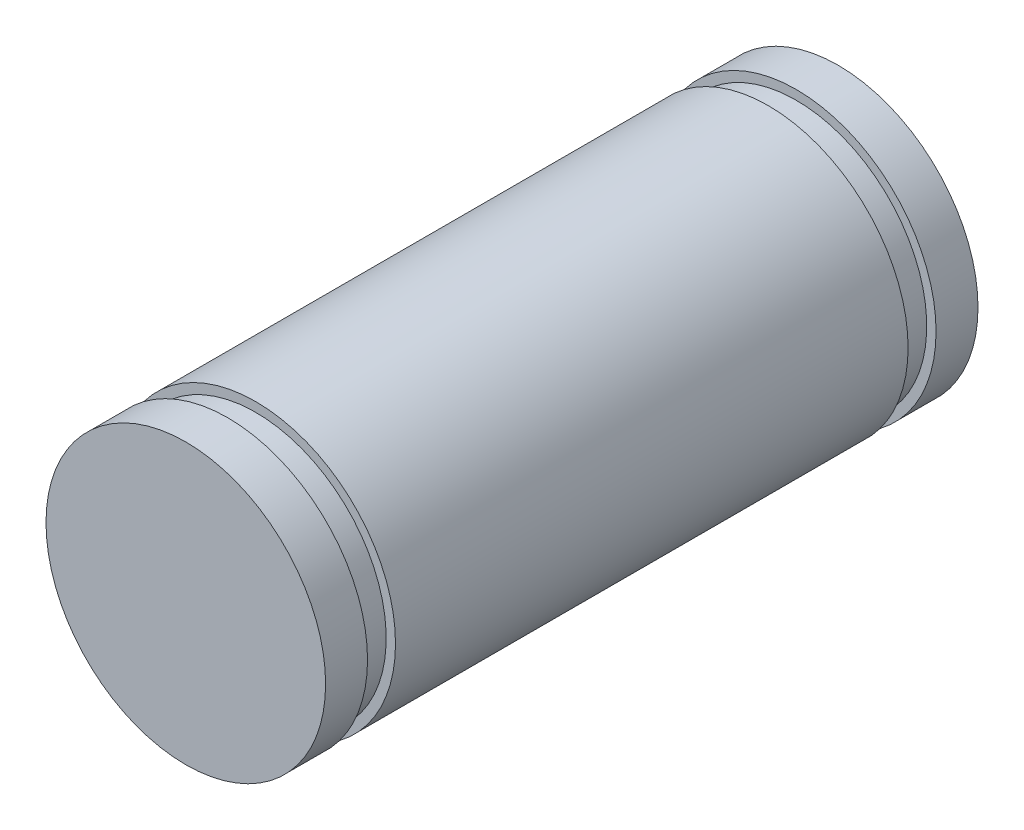
ISO-10303-21;
HEADER;
FILE_DESCRIPTION(('STEP AP214'),'2;1');
FILE_NAME('part.step','',(''),(''),'','','');
FILE_SCHEMA(('AUTOMOTIVE_DESIGN { 1 0 10303 214 1 1 1 1 }'));
ENDSEC;
DATA;
#1=APPLICATION_CONTEXT('core data for automotive mechanical design processes');
#2=APPLICATION_PROTOCOL_DEFINITION('international standard','automotive_design',2000,#1);
#3=PRODUCT_CONTEXT('',#1,'mechanical');
#4=PRODUCT('Part','Part','',(#3));
#5=PRODUCT_RELATED_PRODUCT_CATEGORY('part','',(#4));
#6=PRODUCT_DEFINITION_FORMATION('','',#4);
#7=PRODUCT_DEFINITION_CONTEXT('part definition',#1,'design');
#8=PRODUCT_DEFINITION('design','',#6,#7);
#9=PRODUCT_DEFINITION_SHAPE('','',#8);
#10=(LENGTH_UNIT() NAMED_UNIT(*) SI_UNIT(.MILLI.,.METRE.));
#11=(NAMED_UNIT(*) PLANE_ANGLE_UNIT() SI_UNIT($,.RADIAN.));
#12=(NAMED_UNIT(*) SI_UNIT($,.STERADIAN.) SOLID_ANGLE_UNIT());
#13=UNCERTAINTY_MEASURE_WITH_UNIT(LENGTH_MEASURE(1.E-05),#10,'distance_accuracy_value','');
#14=(GEOMETRIC_REPRESENTATION_CONTEXT(3) GLOBAL_UNCERTAINTY_ASSIGNED_CONTEXT((#13)) GLOBAL_UNIT_ASSIGNED_CONTEXT((#10,
#11,#12)) REPRESENTATION_CONTEXT('',''));
#15=CARTESIAN_POINT('',(0.,0.,0.));
#16=DIRECTION('',(0.,0.,1.));
#17=DIRECTION('',(1.,0.,0.));
#18=AXIS2_PLACEMENT_3D('',#15,#16,#17);
#19=CARTESIAN_POINT('',(0.,0.,14.));
#20=DIRECTION('',(0.,0.,1.));
#21=DIRECTION('',(1.,0.,0.));
#22=AXIS2_PLACEMENT_3D('',#19,#20,#21);
#23=PLANE('',#22);
#24=CARTESIAN_POINT('',(0.,0.,14.));
#25=DIRECTION('',(0.,0.,-1.));
#26=DIRECTION('',(-1.,0.,0.));
#27=AXIS2_PLACEMENT_3D('',#24,#25,#26);
#28=CIRCLE('',#27,3.);
#29=CARTESIAN_POINT('',(-3.,0.,14.));
#30=VERTEX_POINT('',#29);
#31=EDGE_CURVE('E18',#30,#30,#28,.T.);
#32=ORIENTED_EDGE('',*,*,#31,.F.);
#33=EDGE_LOOP('',(#32));
#34=FACE_BOUND('',#33,.T.);
#35=ADVANCED_FACE('F15',(#34),#23,.T.);
#36=CARTESIAN_POINT('',(0.,0.,0.));
#37=DIRECTION('',(0.,0.,1.));
#38=DIRECTION('',(1.,0.,0.));
#39=AXIS2_PLACEMENT_3D('',#36,#37,#38);
#40=PLANE('',#39);
#41=CARTESIAN_POINT('',(0.,0.,0.));
#42=DIRECTION('',(0.,0.,-1.));
#43=DIRECTION('',(-1.,0.,0.));
#44=AXIS2_PLACEMENT_3D('',#41,#42,#43);
#45=CIRCLE('',#44,3.);
#46=CARTESIAN_POINT('',(-3.,0.,0.));
#47=VERTEX_POINT('',#46);
#48=EDGE_CURVE('E46',#47,#47,#45,.F.);
#49=ORIENTED_EDGE('',*,*,#48,.F.);
#50=EDGE_LOOP('',(#49));
#51=FACE_BOUND('',#50,.T.);
#52=ADVANCED_FACE('F57',(#51),#40,.F.);
#53=CARTESIAN_POINT('',(0.,0.,14.));
#54=DIRECTION('',(0.,0.,-1.));
#55=DIRECTION('',(-1.,0.,0.));
#56=AXIS2_PLACEMENT_3D('',#53,#54,#55);
#57=CYLINDRICAL_SURFACE('',#56,3.);
#58=ORIENTED_EDGE('',*,*,#31,.T.);
#59=EDGE_LOOP('',(#58));
#60=FACE_BOUND('',#59,.T.);
#61=CARTESIAN_POINT('',(0.,0.,13.1));
#62=DIRECTION('',(0.,0.,-1.));
#63=DIRECTION('',(-1.,0.,0.));
#64=AXIS2_PLACEMENT_3D('',#61,#62,#63);
#65=CIRCLE('',#64,3.);
#66=CARTESIAN_POINT('',(-3.,0.,13.1));
#67=VERTEX_POINT('',#66);
#68=EDGE_CURVE('E44',#67,#67,#65,.T.);
#69=ORIENTED_EDGE('',*,*,#68,.F.);
#70=EDGE_LOOP('',(#69));
#71=FACE_BOUND('',#70,.T.);
#72=ADVANCED_FACE('F53',(#60,#71),#57,.T.);
#73=CARTESIAN_POINT('',(0.,0.,14.));
#74=DIRECTION('',(0.,0.,-1.));
#75=DIRECTION('',(-1.,0.,0.));
#76=AXIS2_PLACEMENT_3D('',#73,#74,#75);
#77=CYLINDRICAL_SURFACE('',#76,3.);
#78=CARTESIAN_POINT('',(0.,0.,0.9));
#79=DIRECTION('',(0.,0.,-1.));
#80=DIRECTION('',(-1.,0.,0.));
#81=AXIS2_PLACEMENT_3D('',#78,#79,#80);
#82=CIRCLE('',#81,3.);
#83=CARTESIAN_POINT('',(-3.,0.,0.9));
#84=VERTEX_POINT('',#83);
#85=EDGE_CURVE('E41',#84,#84,#82,.F.);
#86=ORIENTED_EDGE('',*,*,#85,.F.);
#87=EDGE_LOOP('',(#86));
#88=FACE_BOUND('',#87,.T.);
#89=ORIENTED_EDGE('',*,*,#48,.T.);
#90=EDGE_LOOP('',(#89));
#91=FACE_BOUND('',#90,.T.);
#92=ADVANCED_FACE('F93',(#88,#91),#77,.T.);
#93=CARTESIAN_POINT('',(3.,0.,13.1));
#94=DIRECTION('',(0.,0.,-1.));
#95=DIRECTION('',(-1.,0.,0.));
#96=AXIS2_PLACEMENT_3D('',#93,#94,#95);
#97=PLANE('',#96);
#98=CARTESIAN_POINT('',(0.,0.,13.1));
#99=DIRECTION('',(0.,0.,-1.));
#100=DIRECTION('',(-1.,0.,0.));
#101=AXIS2_PLACEMENT_3D('',#98,#99,#100);
#102=CIRCLE('',#101,2.8);
#103=CARTESIAN_POINT('',(-2.8,0.,13.1));
#104=VERTEX_POINT('',#103);
#105=EDGE_CURVE('E38',#104,#104,#102,.T.);
#106=ORIENTED_EDGE('',*,*,#105,.F.);
#107=EDGE_LOOP('',(#106));
#108=FACE_BOUND('',#107,.T.);
#109=ORIENTED_EDGE('',*,*,#68,.T.);
#110=EDGE_LOOP('',(#109));
#111=FACE_BOUND('',#110,.T.);
#112=ADVANCED_FACE('F89',(#108,#111),#97,.T.);
#113=CARTESIAN_POINT('',(3.,0.,0.9));
#114=DIRECTION('',(0.,0.,1.));
#115=DIRECTION('',(1.,0.,0.));
#116=AXIS2_PLACEMENT_3D('',#113,#114,#115);
#117=PLANE('',#116);
#118=ORIENTED_EDGE('',*,*,#85,.T.);
#119=EDGE_LOOP('',(#118));
#120=FACE_BOUND('',#119,.T.);
#121=CARTESIAN_POINT('',(0.,0.,0.9));
#122=DIRECTION('',(0.,0.,-1.));
#123=DIRECTION('',(-1.,0.,0.));
#124=AXIS2_PLACEMENT_3D('',#121,#122,#123);
#125=CIRCLE('',#124,2.8);
#126=CARTESIAN_POINT('',(-2.8,0.,0.9));
#127=VERTEX_POINT('',#126);
#128=EDGE_CURVE('E35',#127,#127,#125,.F.);
#129=ORIENTED_EDGE('',*,*,#128,.F.);
#130=EDGE_LOOP('',(#129));
#131=FACE_BOUND('',#130,.T.);
#132=ADVANCED_FACE('F85',(#120,#131),#117,.T.);
#133=CARTESIAN_POINT('',(0.,0.,0.));
#134=DIRECTION('',(0.,0.,-1.));
#135=DIRECTION('',(-1.,0.,0.));
#136=AXIS2_PLACEMENT_3D('',#133,#134,#135);
#137=CYLINDRICAL_SURFACE('',#136,2.8);
#138=ORIENTED_EDGE('',*,*,#105,.T.);
#139=EDGE_LOOP('',(#138));
#140=FACE_BOUND('',#139,.T.);
#141=CARTESIAN_POINT('',(0.,0.,12.5));
#142=DIRECTION('',(0.,0.,-1.));
#143=DIRECTION('',(-1.,0.,0.));
#144=AXIS2_PLACEMENT_3D('',#141,#142,#143);
#145=CIRCLE('',#144,2.8);
#146=CARTESIAN_POINT('',(-2.8,0.,12.5));
#147=VERTEX_POINT('',#146);
#148=EDGE_CURVE('E32',#147,#147,#145,.T.);
#149=ORIENTED_EDGE('',*,*,#148,.F.);
#150=EDGE_LOOP('',(#149));
#151=FACE_BOUND('',#150,.T.);
#152=ADVANCED_FACE('F81',(#140,#151),#137,.T.);
#153=CARTESIAN_POINT('',(0.,0.,0.));
#154=DIRECTION('',(0.,0.,-1.));
#155=DIRECTION('',(-1.,0.,0.));
#156=AXIS2_PLACEMENT_3D('',#153,#154,#155);
#157=CYLINDRICAL_SURFACE('',#156,2.8);
#158=CARTESIAN_POINT('',(0.,0.,1.5));
#159=DIRECTION('',(0.,0.,-1.));
#160=DIRECTION('',(-1.,0.,0.));
#161=AXIS2_PLACEMENT_3D('',#158,#159,#160);
#162=CIRCLE('',#161,2.8);
#163=CARTESIAN_POINT('',(-2.8,0.,1.5));
#164=VERTEX_POINT('',#163);
#165=EDGE_CURVE('E27',#164,#164,#162,.F.);
#166=ORIENTED_EDGE('',*,*,#165,.F.);
#167=EDGE_LOOP('',(#166));
#168=FACE_BOUND('',#167,.T.);
#169=ORIENTED_EDGE('',*,*,#128,.T.);
#170=EDGE_LOOP('',(#169));
#171=FACE_BOUND('',#170,.T.);
#172=ADVANCED_FACE('F77',(#168,#171),#157,.T.);
#173=CARTESIAN_POINT('',(3.,0.,12.5));
#174=DIRECTION('',(0.,0.,1.));
#175=DIRECTION('',(1.,0.,0.));
#176=AXIS2_PLACEMENT_3D('',#173,#174,#175);
#177=PLANE('',#176);
#178=CARTESIAN_POINT('',(0.,0.,12.5));
#179=DIRECTION('',(0.,0.,-1.));
#180=DIRECTION('',(-1.,0.,0.));
#181=AXIS2_PLACEMENT_3D('',#178,#179,#180);
#182=CIRCLE('',#181,3.);
#183=CARTESIAN_POINT('',(-3.,0.,12.5));
#184=VERTEX_POINT('',#183);
#185=EDGE_CURVE('E22',#184,#184,#182,.T.);
#186=ORIENTED_EDGE('',*,*,#185,.F.);
#187=EDGE_LOOP('',(#186));
#188=FACE_BOUND('',#187,.T.);
#189=ORIENTED_EDGE('',*,*,#148,.T.);
#190=EDGE_LOOP('',(#189));
#191=FACE_BOUND('',#190,.T.);
#192=ADVANCED_FACE('F70',(#188,#191),#177,.T.);
#193=CARTESIAN_POINT('',(3.,0.,1.5));
#194=DIRECTION('',(0.,0.,-1.));
#195=DIRECTION('',(-1.,0.,0.));
#196=AXIS2_PLACEMENT_3D('',#193,#194,#195);
#197=PLANE('',#196);
#198=ORIENTED_EDGE('',*,*,#165,.T.);
#199=EDGE_LOOP('',(#198));
#200=FACE_BOUND('',#199,.T.);
#201=CARTESIAN_POINT('',(0.,0.,1.5));
#202=DIRECTION('',(0.,0.,-1.));
#203=DIRECTION('',(-1.,0.,0.));
#204=AXIS2_PLACEMENT_3D('',#201,#202,#203);
#205=CIRCLE('',#204,3.);
#206=CARTESIAN_POINT('',(-3.,0.,1.5));
#207=VERTEX_POINT('',#206);
#208=EDGE_CURVE('E10',#207,#207,#205,.F.);
#209=ORIENTED_EDGE('',*,*,#208,.F.);
#210=EDGE_LOOP('',(#209));
#211=FACE_BOUND('',#210,.T.);
#212=ADVANCED_FACE('F65',(#200,#211),#197,.T.);
#213=CARTESIAN_POINT('',(0.,0.,14.));
#214=DIRECTION('',(0.,0.,-1.));
#215=DIRECTION('',(-1.,0.,0.));
#216=AXIS2_PLACEMENT_3D('',#213,#214,#215);
#217=CYLINDRICAL_SURFACE('',#216,3.);
#218=ORIENTED_EDGE('',*,*,#208,.T.);
#219=EDGE_LOOP('',(#218));
#220=FACE_BOUND('',#219,.T.);
#221=ORIENTED_EDGE('',*,*,#185,.T.);
#222=EDGE_LOOP('',(#221));
#223=FACE_BOUND('',#222,.T.);
#224=ADVANCED_FACE('F63',(#220,#223),#217,.T.);
#225=CLOSED_SHELL('',(#35,#52,#72,#92,#112,#132,#152,#172,#192,#212,#224));
#226=MANIFOLD_SOLID_BREP('B1',#225);
#227=ADVANCED_BREP_SHAPE_REPRESENTATION('',(#18,#226),#14);
#228=SHAPE_DEFINITION_REPRESENTATION(#9,#227);
ENDSEC;
END-ISO-10303-21;
